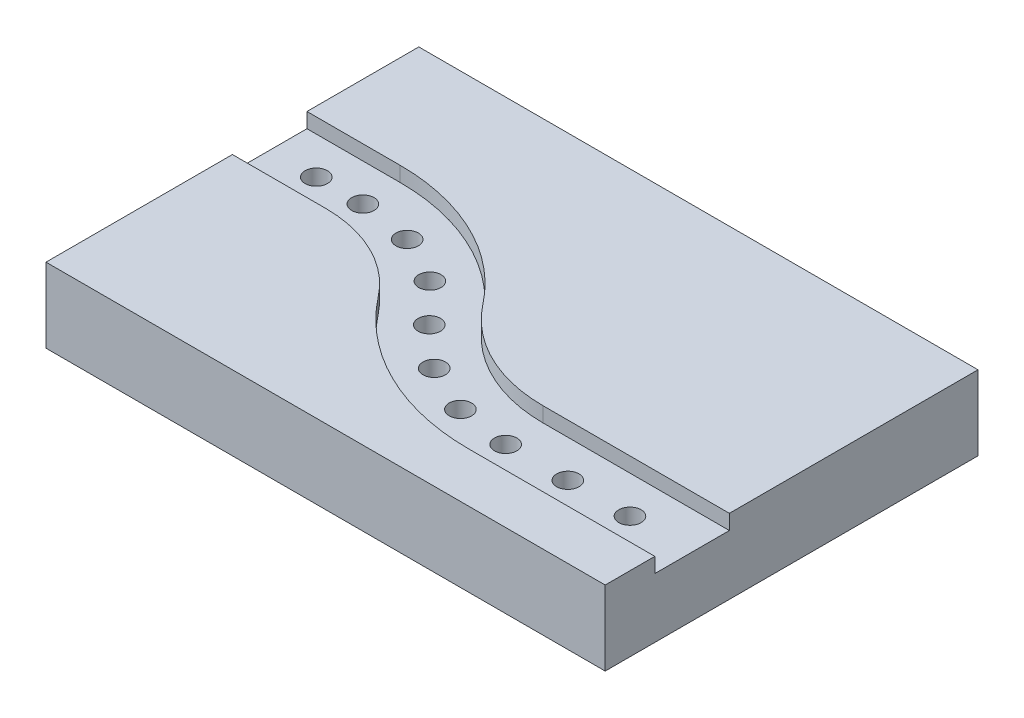
ISO-10303-21;
HEADER;
FILE_DESCRIPTION(('STEP AP214'),'2;1');
FILE_NAME('part.step','',(''),(''),'','','');
FILE_SCHEMA(('AUTOMOTIVE_DESIGN { 1 0 10303 214 1 1 1 1 }'));
ENDSEC;
DATA;
#1=APPLICATION_CONTEXT('core data for automotive mechanical design processes');
#2=APPLICATION_PROTOCOL_DEFINITION('international standard','automotive_design',2000,#1);
#3=PRODUCT_CONTEXT('',#1,'mechanical');
#4=PRODUCT('Part','Part','',(#3));
#5=PRODUCT_RELATED_PRODUCT_CATEGORY('part','',(#4));
#6=PRODUCT_DEFINITION_FORMATION('','',#4);
#7=PRODUCT_DEFINITION_CONTEXT('part definition',#1,'design');
#8=PRODUCT_DEFINITION('design','',#6,#7);
#9=PRODUCT_DEFINITION_SHAPE('','',#8);
#10=(LENGTH_UNIT() NAMED_UNIT(*) SI_UNIT(.MILLI.,.METRE.));
#11=(NAMED_UNIT(*) PLANE_ANGLE_UNIT() SI_UNIT($,.RADIAN.));
#12=(NAMED_UNIT(*) SI_UNIT($,.STERADIAN.) SOLID_ANGLE_UNIT());
#13=UNCERTAINTY_MEASURE_WITH_UNIT(LENGTH_MEASURE(1.E-05),#10,'distance_accuracy_value','');
#14=(GEOMETRIC_REPRESENTATION_CONTEXT(3) GLOBAL_UNCERTAINTY_ASSIGNED_CONTEXT((#13)) GLOBAL_UNIT_ASSIGNED_CONTEXT((#10,
#11,#12)) REPRESENTATION_CONTEXT('',''));
#15=CARTESIAN_POINT('',(0.,0.,0.));
#16=DIRECTION('',(0.,0.,1.));
#17=DIRECTION('',(1.,0.,0.));
#18=AXIS2_PLACEMENT_3D('',#15,#16,#17);
#19=CARTESIAN_POINT('',(0.,20.,0.));
#20=DIRECTION('',(0.,1.,0.));
#21=DIRECTION('',(0.,0.,1.));
#22=AXIS2_PLACEMENT_3D('',#19,#20,#21);
#23=PLANE('',#22);
#24=DIRECTION('',(0.,0.,1.));
#25=VECTOR('',#24,1.);
#26=CARTESIAN_POINT('',(0.,20.,0.));
#27=LINE('',#26,#25);
#28=CARTESIAN_POINT('',(0.,20.,0.));
#29=VERTEX_POINT('',#28);
#30=CARTESIAN_POINT('',(0.,20.,30.));
#31=VERTEX_POINT('',#30);
#32=EDGE_CURVE('E267',#29,#31,#27,.T.);
#33=ORIENTED_EDGE('',*,*,#32,.T.);
#34=DIRECTION('',(1.,0.,0.));
#35=VECTOR('',#34,1.);
#36=CARTESIAN_POINT('',(0.,20.,30.));
#37=LINE('',#36,#35);
#38=CARTESIAN_POINT('',(25.,20.,30.));
#39=VERTEX_POINT('',#38);
#40=EDGE_CURVE('E237',#31,#39,#37,.T.);
#41=ORIENTED_EDGE('',*,*,#40,.T.);
#42=CARTESIAN_POINT('',(25.,20.,85.));
#43=DIRECTION('',(0.,1.,0.));
#44=DIRECTION('',(1.,0.,0.));
#45=AXIS2_PLACEMENT_3D('',#42,#43,#44);
#46=CIRCLE('',#45,55.);
#47=CARTESIAN_POINT('',(68.421052631579,20.,51.2418574508957));
#48=VERTEX_POINT('',#47);
#49=EDGE_CURVE('E234',#39,#48,#46,.F.);
#50=ORIENTED_EDGE('',*,*,#49,.T.);
#51=CARTESIAN_POINT('',(100.,20.,26.690481051547));
#52=DIRECTION('',(0.,1.,0.));
#53=DIRECTION('',(1.,0.,0.));
#54=AXIS2_PLACEMENT_3D('',#51,#52,#53);
#55=CIRCLE('',#54,40.);
#56=CARTESIAN_POINT('',(100.,20.,66.6904810515471));
#57=VERTEX_POINT('',#56);
#58=EDGE_CURVE('E231',#48,#57,#55,.T.);
#59=ORIENTED_EDGE('',*,*,#58,.T.);
#60=DIRECTION('',(1.,0.,0.));
#61=VECTOR('',#60,1.);
#62=CARTESIAN_POINT('',(100.,20.,66.6904810515471));
#63=LINE('',#62,#61);
#64=CARTESIAN_POINT('',(150.,20.,66.6904810515471));
#65=VERTEX_POINT('',#64);
#66=EDGE_CURVE('E228',#57,#65,#63,.T.);
#67=ORIENTED_EDGE('',*,*,#66,.T.);
#68=DIRECTION('',(0.,0.,-1.));
#69=VECTOR('',#68,1.);
#70=CARTESIAN_POINT('',(150.,20.,0.));
#71=LINE('',#70,#69);
#72=CARTESIAN_POINT('',(150.,20.,0.));
#73=VERTEX_POINT('',#72);
#74=EDGE_CURVE('E271',#65,#73,#71,.T.);
#75=ORIENTED_EDGE('',*,*,#74,.T.);
#76=DIRECTION('',(-1.,0.,0.));
#77=VECTOR('',#76,1.);
#78=CARTESIAN_POINT('',(0.,20.,0.));
#79=LINE('',#78,#77);
#80=EDGE_CURVE('E94',#73,#29,#79,.T.);
#81=ORIENTED_EDGE('',*,*,#80,.T.);
#82=EDGE_LOOP('',(#33,#41,#50,#59,#67,#75,#81));
#83=FACE_BOUND('',#82,.T.);
#84=ADVANCED_FACE('F70',(#83),#23,.T.);
#85=CARTESIAN_POINT('',(0.,20.,0.));
#86=DIRECTION('',(1.,0.,0.));
#87=DIRECTION('',(0.,0.,-1.));
#88=AXIS2_PLACEMENT_3D('',#85,#86,#87);
#89=PLANE('',#88);
#90=CARTESIAN_POINT('',(0.,20.,50.));
#91=VERTEX_POINT('',#90);
#92=CARTESIAN_POINT('',(0.,20.,100.));
#93=VERTEX_POINT('',#92);
#94=EDGE_CURVE('E123',#91,#93,#27,.T.);
#95=ORIENTED_EDGE('',*,*,#94,.F.);
#96=DIRECTION('',(0.,1.,0.));
#97=VECTOR('',#96,1.);
#98=CARTESIAN_POINT('',(0.,16.,50.));
#99=LINE('',#98,#97);
#100=CARTESIAN_POINT('',(0.,16.,50.));
#101=VERTEX_POINT('',#100);
#102=EDGE_CURVE('E255',#101,#91,#99,.T.);
#103=ORIENTED_EDGE('',*,*,#102,.F.);
#104=DIRECTION('',(0.,0.,-1.));
#105=VECTOR('',#104,1.);
#106=CARTESIAN_POINT('',(0.,16.,50.));
#107=LINE('',#106,#105);
#108=CARTESIAN_POINT('',(0.,16.,30.));
#109=VERTEX_POINT('',#108);
#110=EDGE_CURVE('E218',#101,#109,#107,.T.);
#111=ORIENTED_EDGE('',*,*,#110,.T.);
#112=DIRECTION('',(0.,1.,0.));
#113=VECTOR('',#112,1.);
#114=CARTESIAN_POINT('',(0.,16.,30.));
#115=LINE('',#114,#113);
#116=EDGE_CURVE('E257',#109,#31,#115,.T.);
#117=ORIENTED_EDGE('',*,*,#116,.T.);
#118=ORIENTED_EDGE('',*,*,#32,.F.);
#119=DIRECTION('',(0.,-1.,0.));
#120=VECTOR('',#119,1.);
#121=CARTESIAN_POINT('',(0.,20.,0.));
#122=LINE('',#121,#120);
#123=CARTESIAN_POINT('',(0.,0.,0.));
#124=VERTEX_POINT('',#123);
#125=EDGE_CURVE('E275',#29,#124,#122,.T.);
#126=ORIENTED_EDGE('',*,*,#125,.T.);
#127=DIRECTION('',(0.,0.,1.));
#128=VECTOR('',#127,1.);
#129=CARTESIAN_POINT('',(0.,0.,0.));
#130=LINE('',#129,#128);
#131=CARTESIAN_POINT('',(0.,0.,100.));
#132=VERTEX_POINT('',#131);
#133=EDGE_CURVE('E250',#124,#132,#130,.T.);
#134=ORIENTED_EDGE('',*,*,#133,.T.);
#135=DIRECTION('',(0.,-1.,0.));
#136=VECTOR('',#135,1.);
#137=CARTESIAN_POINT('',(0.,20.,100.));
#138=LINE('',#137,#136);
#139=EDGE_CURVE('E13',#93,#132,#138,.T.);
#140=ORIENTED_EDGE('',*,*,#139,.F.);
#141=EDGE_LOOP('',(#95,#103,#111,#117,#118,#126,#134,#140));
#142=FACE_BOUND('',#141,.T.);
#143=ADVANCED_FACE('F72',(#142),#89,.F.);
#144=CARTESIAN_POINT('',(0.,20.,100.));
#145=DIRECTION('',(0.,0.,-1.));
#146=DIRECTION('',(-1.,0.,0.));
#147=AXIS2_PLACEMENT_3D('',#144,#145,#146);
#148=PLANE('',#147);
#149=DIRECTION('',(1.,0.,0.));
#150=VECTOR('',#149,1.);
#151=CARTESIAN_POINT('',(0.,0.,100.));
#152=LINE('',#151,#150);
#153=CARTESIAN_POINT('',(150.,0.,100.));
#154=VERTEX_POINT('',#153);
#155=EDGE_CURVE('E278',#132,#154,#152,.T.);
#156=ORIENTED_EDGE('',*,*,#155,.T.);
#157=DIRECTION('',(0.,-1.,0.));
#158=VECTOR('',#157,1.);
#159=CARTESIAN_POINT('',(150.,20.,100.));
#160=LINE('',#159,#158);
#161=CARTESIAN_POINT('',(150.,20.,100.));
#162=VERTEX_POINT('',#161);
#163=EDGE_CURVE('E78',#162,#154,#160,.T.);
#164=ORIENTED_EDGE('',*,*,#163,.F.);
#165=DIRECTION('',(1.,0.,0.));
#166=VECTOR('',#165,1.);
#167=CARTESIAN_POINT('',(0.,20.,100.));
#168=LINE('',#167,#166);
#169=EDGE_CURVE('E269',#93,#162,#168,.T.);
#170=ORIENTED_EDGE('',*,*,#169,.F.);
#171=ORIENTED_EDGE('',*,*,#139,.T.);
#172=EDGE_LOOP('',(#156,#164,#170,#171));
#173=FACE_BOUND('',#172,.T.);
#174=ADVANCED_FACE('F325',(#173),#148,.F.);
#175=CARTESIAN_POINT('',(150.,20.,0.));
#176=DIRECTION('',(-1.,0.,0.));
#177=DIRECTION('',(0.,0.,1.));
#178=AXIS2_PLACEMENT_3D('',#175,#176,#177);
#179=PLANE('',#178);
#180=DIRECTION('',(0.,0.,1.));
#181=VECTOR('',#180,1.);
#182=CARTESIAN_POINT('',(150.,16.,66.6904810515471));
#183=LINE('',#182,#181);
#184=CARTESIAN_POINT('',(150.,16.,66.6904810515471));
#185=VERTEX_POINT('',#184);
#186=CARTESIAN_POINT('',(150.,16.,86.690481051547));
#187=VERTEX_POINT('',#186);
#188=EDGE_CURVE('E200',#185,#187,#183,.T.);
#189=ORIENTED_EDGE('',*,*,#188,.T.);
#190=DIRECTION('',(0.,1.,0.));
#191=VECTOR('',#190,1.);
#192=CARTESIAN_POINT('',(150.,16.,86.690481051547));
#193=LINE('',#192,#191);
#194=CARTESIAN_POINT('',(150.,20.,86.690481051547));
#195=VERTEX_POINT('',#194);
#196=EDGE_CURVE('E183',#187,#195,#193,.T.);
#197=ORIENTED_EDGE('',*,*,#196,.T.);
#198=EDGE_CURVE('E272',#162,#195,#71,.T.);
#199=ORIENTED_EDGE('',*,*,#198,.F.);
#200=ORIENTED_EDGE('',*,*,#163,.T.);
#201=DIRECTION('',(0.,0.,-1.));
#202=VECTOR('',#201,1.);
#203=CARTESIAN_POINT('',(150.,0.,0.));
#204=LINE('',#203,#202);
#205=CARTESIAN_POINT('',(150.,0.,0.));
#206=VERTEX_POINT('',#205);
#207=EDGE_CURVE('E280',#154,#206,#204,.T.);
#208=ORIENTED_EDGE('',*,*,#207,.T.);
#209=DIRECTION('',(0.,-1.,0.));
#210=VECTOR('',#209,1.);
#211=CARTESIAN_POINT('',(150.,20.,0.));
#212=LINE('',#211,#210);
#213=EDGE_CURVE('E285',#73,#206,#212,.T.);
#214=ORIENTED_EDGE('',*,*,#213,.F.);
#215=ORIENTED_EDGE('',*,*,#74,.F.);
#216=DIRECTION('',(0.,1.,0.));
#217=VECTOR('',#216,1.);
#218=CARTESIAN_POINT('',(150.,16.,66.6904810515471));
#219=LINE('',#218,#217);
#220=EDGE_CURVE('E85',#185,#65,#219,.T.);
#221=ORIENTED_EDGE('',*,*,#220,.F.);
#222=EDGE_LOOP('',(#189,#197,#199,#200,#208,#214,#215,#221));
#223=FACE_BOUND('',#222,.T.);
#224=ADVANCED_FACE('F205',(#223),#179,.F.);
#225=CARTESIAN_POINT('',(0.,20.,0.));
#226=DIRECTION('',(0.,0.,1.));
#227=DIRECTION('',(1.,0.,0.));
#228=AXIS2_PLACEMENT_3D('',#225,#226,#227);
#229=PLANE('',#228);
#230=DIRECTION('',(-1.,0.,0.));
#231=VECTOR('',#230,1.);
#232=CARTESIAN_POINT('',(0.,0.,0.));
#233=LINE('',#232,#231);
#234=EDGE_CURVE('E115',#206,#124,#233,.T.);
#235=ORIENTED_EDGE('',*,*,#234,.T.);
#236=ORIENTED_EDGE('',*,*,#125,.F.);
#237=ORIENTED_EDGE('',*,*,#80,.F.);
#238=ORIENTED_EDGE('',*,*,#213,.T.);
#239=EDGE_LOOP('',(#235,#236,#237,#238));
#240=FACE_BOUND('',#239,.T.);
#241=ADVANCED_FACE('F297',(#240),#229,.F.);
#242=DIRECTION('',(1.,0.,0.));
#243=VECTOR('',#242,1.);
#244=CARTESIAN_POINT('',(100.,20.,86.690481051547));
#245=LINE('',#244,#243);
#246=CARTESIAN_POINT('',(100.,20.,86.690481051547));
#247=VERTEX_POINT('',#246);
#248=EDGE_CURVE('E189',#247,#195,#245,.T.);
#249=ORIENTED_EDGE('',*,*,#248,.F.);
#250=CARTESIAN_POINT('',(100.,20.,26.690481051547));
#251=DIRECTION('',(0.,1.,0.));
#252=DIRECTION('',(1.,0.,0.));
#253=AXIS2_PLACEMENT_3D('',#250,#251,#252);
#254=CIRCLE('',#253,60.);
#255=CARTESIAN_POINT('',(52.6315789473684,20.,63.51754565057));
#256=VERTEX_POINT('',#255);
#257=EDGE_CURVE('E203',#256,#247,#254,.T.);
#258=ORIENTED_EDGE('',*,*,#257,.F.);
#259=CARTESIAN_POINT('',(25.,20.,85.));
#260=DIRECTION('',(0.,1.,0.));
#261=DIRECTION('',(1.,0.,0.));
#262=AXIS2_PLACEMENT_3D('',#259,#260,#261);
#263=CIRCLE('',#262,35.);
#264=CARTESIAN_POINT('',(25.,20.,50.));
#265=VERTEX_POINT('',#264);
#266=EDGE_CURVE('E243',#265,#256,#263,.F.);
#267=ORIENTED_EDGE('',*,*,#266,.F.);
#268=DIRECTION('',(1.,0.,0.));
#269=VECTOR('',#268,1.);
#270=CARTESIAN_POINT('',(0.,20.,50.));
#271=LINE('',#270,#269);
#272=EDGE_CURVE('E240',#91,#265,#271,.T.);
#273=ORIENTED_EDGE('',*,*,#272,.F.);
#274=ORIENTED_EDGE('',*,*,#94,.T.);
#275=ORIENTED_EDGE('',*,*,#169,.T.);
#276=ORIENTED_EDGE('',*,*,#198,.T.);
#277=EDGE_LOOP('',(#249,#258,#267,#273,#274,#275,#276));
#278=FACE_BOUND('',#277,.T.);
#279=ADVANCED_FACE('F318',(#278),#23,.T.);
#280=CARTESIAN_POINT('',(0.,0.,0.));
#281=DIRECTION('',(0.,1.,0.));
#282=DIRECTION('',(0.,0.,1.));
#283=AXIS2_PLACEMENT_3D('',#280,#281,#282);
#284=PLANE('',#283);
#285=CARTESIAN_POINT('',(100.,0.,76.6904810515471));
#286=DIRECTION('',(0.,1.,0.));
#287=DIRECTION('',(0.,0.,1.));
#288=AXIS2_PLACEMENT_3D('',#285,#286,#287);
#289=CIRCLE('',#288,3.);
#290=CARTESIAN_POINT('',(100.,0.,79.6904810515471));
#291=VERTEX_POINT('',#290);
#292=EDGE_CURVE('E546',#291,#291,#289,.T.);
#293=ORIENTED_EDGE('',*,*,#292,.T.);
#294=EDGE_LOOP('',(#293));
#295=FACE_BOUND('',#294,.T.);
#296=CARTESIAN_POINT('',(85.7909951199552,0.,74.6290269235159));
#297=DIRECTION('',(0.,1.,0.));
#298=DIRECTION('',(-0.284180097600883,0.,0.958770917439381));
#299=AXIS2_PLACEMENT_3D('',#296,#297,#298);
#300=CIRCLE('',#299,3.);
#301=CARTESIAN_POINT('',(84.9384548271526,0.,77.505339675834));
#302=VERTEX_POINT('',#301);
#303=EDGE_CURVE('E550',#302,#302,#300,.T.);
#304=ORIENTED_EDGE('',*,*,#303,.T.);
#305=EDGE_LOOP('',(#304));
#306=FACE_BOUND('',#305,.T.);
#307=CARTESIAN_POINT('',(72.7536387105177,0.,68.6146482643015));
#308=DIRECTION('',(0.,1.,0.));
#309=DIRECTION('',(-0.544927225789634,0.,0.838483344255098));
#310=AXIS2_PLACEMENT_3D('',#307,#308,#309);
#311=CIRCLE('',#310,3.);
#312=CARTESIAN_POINT('',(71.1188570331488,0.,71.1300982970668));
#313=VERTEX_POINT('',#312);
#314=EDGE_CURVE('E559',#313,#313,#311,.T.);
#315=ORIENTED_EDGE('',*,*,#314,.T.);
#316=EDGE_LOOP('',(#315));
#317=FACE_BOUND('',#316,.T.);
#318=CARTESIAN_POINT('',(61.9629672592414,0.,59.1432797024871));
#319=DIRECTION('',(0.,1.,0.));
#320=DIRECTION('',(-0.760740654815163,0.,0.649055973018813));
#321=AXIS2_PLACEMENT_3D('',#318,#319,#320);
#322=CIRCLE('',#321,3.);
#323=CARTESIAN_POINT('',(59.6807452947959,0.,61.0904476215436));
#324=VERTEX_POINT('',#323);
#325=EDGE_CURVE('E565',#324,#324,#322,.T.);
#326=ORIENTED_EDGE('',*,*,#325,.T.);
#327=EDGE_LOOP('',(#326));
#328=FACE_BOUND('',#327,.T.);
#329=CARTESIAN_POINT('',(51.8859178089722,0.,48.9147201262178));
#330=DIRECTION('',(0.,1.,0.));
#331=DIRECTION('',(-0.59746484019937,0.,0.801895108306281));
#332=AXIS2_PLACEMENT_3D('',#329,#330,#331);
#333=CIRCLE('',#332,3.);
#334=CARTESIAN_POINT('',(50.093523288374,0.,51.3204054511366));
#335=VERTEX_POINT('',#334);
#336=EDGE_CURVE('E571',#335,#335,#333,.T.);
#337=ORIENTED_EDGE('',*,*,#336,.T.);
#338=EDGE_LOOP('',(#337));
#339=FACE_BOUND('',#338,.T.);
#340=CARTESIAN_POINT('',(39.1626693402021,0.,42.2867842798028));
#341=DIRECTION('',(0.,1.,0.));
#342=DIRECTION('',(-0.31472598533781,0.,0.949182571559942));
#343=AXIS2_PLACEMENT_3D('',#340,#341,#342);
#344=CIRCLE('',#343,3.);
#345=CARTESIAN_POINT('',(38.2184913841886,0.,45.1343319944826));
#346=VERTEX_POINT('',#345);
#347=EDGE_CURVE('E577',#346,#346,#344,.T.);
#348=ORIENTED_EDGE('',*,*,#347,.T.);
#349=EDGE_LOOP('',(#348));
#350=FACE_BOUND('',#349,.T.);
#351=CARTESIAN_POINT('',(133.333333333333,0.,76.6904810515471));
#352=DIRECTION('',(0.,1.,0.));
#353=DIRECTION('',(0.,0.,1.));
#354=AXIS2_PLACEMENT_3D('',#351,#352,#353);
#355=CIRCLE('',#354,3.);
#356=CARTESIAN_POINT('',(133.333333333333,0.,79.6904810515471));
#357=VERTEX_POINT('',#356);
#358=EDGE_CURVE('E583',#357,#357,#355,.T.);
#359=ORIENTED_EDGE('',*,*,#358,.T.);
#360=EDGE_LOOP('',(#359));
#361=FACE_BOUND('',#360,.T.);
#362=CARTESIAN_POINT('',(116.666666666667,0.,76.6904810515471));
#363=DIRECTION('',(0.,1.,0.));
#364=DIRECTION('',(0.,0.,1.));
#365=AXIS2_PLACEMENT_3D('',#362,#363,#364);
#366=CIRCLE('',#365,3.);
#367=CARTESIAN_POINT('',(116.666666666667,0.,79.6904810515471));
#368=VERTEX_POINT('',#367);
#369=EDGE_CURVE('E589',#368,#368,#366,.T.);
#370=ORIENTED_EDGE('',*,*,#369,.T.);
#371=EDGE_LOOP('',(#370));
#372=FACE_BOUND('',#371,.T.);
#373=CARTESIAN_POINT('',(12.5,0.,40.));
#374=DIRECTION('',(0.,1.,0.));
#375=DIRECTION('',(0.,0.,1.));
#376=AXIS2_PLACEMENT_3D('',#373,#374,#375);
#377=CIRCLE('',#376,3.);
#378=CARTESIAN_POINT('',(12.5,0.,43.));
#379=VERTEX_POINT('',#378);
#380=EDGE_CURVE('E595',#379,#379,#377,.T.);
#381=ORIENTED_EDGE('',*,*,#380,.T.);
#382=EDGE_LOOP('',(#381));
#383=FACE_BOUND('',#382,.T.);
#384=CARTESIAN_POINT('',(25.,0.,40.));
#385=DIRECTION('',(0.,1.,0.));
#386=DIRECTION('',(0.,0.,1.));
#387=AXIS2_PLACEMENT_3D('',#384,#385,#386);
#388=CIRCLE('',#387,3.);
#389=CARTESIAN_POINT('',(25.,0.,43.));
#390=VERTEX_POINT('',#389);
#391=EDGE_CURVE('E229',#390,#390,#388,.T.);
#392=ORIENTED_EDGE('',*,*,#391,.T.);
#393=EDGE_LOOP('',(#392));
#394=FACE_BOUND('',#393,.T.);
#395=ORIENTED_EDGE('',*,*,#133,.F.);
#396=ORIENTED_EDGE('',*,*,#234,.F.);
#397=ORIENTED_EDGE('',*,*,#207,.F.);
#398=ORIENTED_EDGE('',*,*,#155,.F.);
#399=EDGE_LOOP('',(#395,#396,#397,#398));
#400=FACE_BOUND('',#399,.T.);
#401=ADVANCED_FACE('F293',(#295,#306,#317,#328,#339,#350,#361,#372,#383,#394,#400),#284,.F.);
#402=CARTESIAN_POINT('',(100.,16.,86.690481051547));
#403=DIRECTION('',(0.,0.,1.));
#404=DIRECTION('',(1.,0.,0.));
#405=AXIS2_PLACEMENT_3D('',#402,#403,#404);
#406=PLANE('',#405);
#407=ORIENTED_EDGE('',*,*,#248,.T.);
#408=ORIENTED_EDGE('',*,*,#196,.F.);
#409=DIRECTION('',(1.,0.,0.));
#410=VECTOR('',#409,1.);
#411=CARTESIAN_POINT('',(100.,16.,86.690481051547));
#412=LINE('',#411,#410);
#413=CARTESIAN_POINT('',(100.,16.,86.690481051547));
#414=VERTEX_POINT('',#413);
#415=EDGE_CURVE('E186',#414,#187,#412,.T.);
#416=ORIENTED_EDGE('',*,*,#415,.F.);
#417=DIRECTION('',(0.,1.,0.));
#418=VECTOR('',#417,1.);
#419=CARTESIAN_POINT('',(100.,16.,86.690481051547));
#420=LINE('',#419,#418);
#421=EDGE_CURVE('E248',#414,#247,#420,.T.);
#422=ORIENTED_EDGE('',*,*,#421,.T.);
#423=EDGE_LOOP('',(#407,#408,#416,#422));
#424=FACE_BOUND('',#423,.T.);
#425=ADVANCED_FACE('F185',(#424),#406,.F.);
#426=CARTESIAN_POINT('',(100.,16.,26.690481051547));
#427=DIRECTION('',(0.,1.,0.));
#428=DIRECTION('',(0.,0.,1.));
#429=AXIS2_PLACEMENT_3D('',#426,#427,#428);
#430=CYLINDRICAL_SURFACE('',#429,60.);
#431=ORIENTED_EDGE('',*,*,#257,.T.);
#432=ORIENTED_EDGE('',*,*,#421,.F.);
#433=CARTESIAN_POINT('',(100.,16.,26.690481051547));
#434=DIRECTION('',(0.,1.,0.));
#435=DIRECTION('',(1.,0.,0.));
#436=AXIS2_PLACEMENT_3D('',#433,#434,#435);
#437=CIRCLE('',#436,60.);
#438=CARTESIAN_POINT('',(52.6315789473684,16.,63.51754565057));
#439=VERTEX_POINT('',#438);
#440=EDGE_CURVE('E194',#439,#414,#437,.T.);
#441=ORIENTED_EDGE('',*,*,#440,.F.);
#442=DIRECTION('',(0.,1.,0.));
#443=VECTOR('',#442,1.);
#444=CARTESIAN_POINT('',(52.6315789473684,16.,63.51754565057));
#445=LINE('',#444,#443);
#446=EDGE_CURVE('E251',#439,#256,#445,.T.);
#447=ORIENTED_EDGE('',*,*,#446,.T.);
#448=EDGE_LOOP('',(#431,#432,#441,#447));
#449=FACE_BOUND('',#448,.T.);
#450=ADVANCED_FACE('F324',(#449),#430,.F.);
#451=CARTESIAN_POINT('',(25.,16.,85.));
#452=DIRECTION('',(0.,1.,0.));
#453=DIRECTION('',(0.,0.,1.));
#454=AXIS2_PLACEMENT_3D('',#451,#452,#453);
#455=CYLINDRICAL_SURFACE('',#454,35.);
#456=ORIENTED_EDGE('',*,*,#266,.T.);
#457=ORIENTED_EDGE('',*,*,#446,.F.);
#458=CARTESIAN_POINT('',(25.,16.,85.));
#459=DIRECTION('',(0.,1.,0.));
#460=DIRECTION('',(1.,0.,0.));
#461=AXIS2_PLACEMENT_3D('',#458,#459,#460);
#462=CIRCLE('',#461,35.);
#463=CARTESIAN_POINT('',(25.,16.,50.));
#464=VERTEX_POINT('',#463);
#465=EDGE_CURVE('E224',#464,#439,#462,.F.);
#466=ORIENTED_EDGE('',*,*,#465,.F.);
#467=DIRECTION('',(0.,1.,0.));
#468=VECTOR('',#467,1.);
#469=CARTESIAN_POINT('',(25.,16.,50.));
#470=LINE('',#469,#468);
#471=EDGE_CURVE('E253',#464,#265,#470,.T.);
#472=ORIENTED_EDGE('',*,*,#471,.T.);
#473=EDGE_LOOP('',(#456,#457,#466,#472));
#474=FACE_BOUND('',#473,.T.);
#475=ADVANCED_FACE('F321',(#474),#455,.T.);
#476=CARTESIAN_POINT('',(0.,16.,50.));
#477=DIRECTION('',(0.,0.,1.));
#478=DIRECTION('',(1.,0.,0.));
#479=AXIS2_PLACEMENT_3D('',#476,#477,#478);
#480=PLANE('',#479);
#481=ORIENTED_EDGE('',*,*,#272,.T.);
#482=ORIENTED_EDGE('',*,*,#471,.F.);
#483=DIRECTION('',(1.,0.,0.));
#484=VECTOR('',#483,1.);
#485=CARTESIAN_POINT('',(0.,16.,50.));
#486=LINE('',#485,#484);
#487=EDGE_CURVE('E221',#101,#464,#486,.T.);
#488=ORIENTED_EDGE('',*,*,#487,.F.);
#489=ORIENTED_EDGE('',*,*,#102,.T.);
#490=EDGE_LOOP('',(#481,#482,#488,#489));
#491=FACE_BOUND('',#490,.T.);
#492=ADVANCED_FACE('F316',(#491),#480,.F.);
#493=CARTESIAN_POINT('',(0.,16.,30.));
#494=DIRECTION('',(0.,0.,1.));
#495=DIRECTION('',(1.,0.,0.));
#496=AXIS2_PLACEMENT_3D('',#493,#494,#495);
#497=PLANE('',#496);
#498=ORIENTED_EDGE('',*,*,#40,.F.);
#499=ORIENTED_EDGE('',*,*,#116,.F.);
#500=DIRECTION('',(1.,0.,0.));
#501=VECTOR('',#500,1.);
#502=CARTESIAN_POINT('',(0.,16.,30.));
#503=LINE('',#502,#501);
#504=CARTESIAN_POINT('',(25.,16.,30.));
#505=VERTEX_POINT('',#504);
#506=EDGE_CURVE('E216',#109,#505,#503,.T.);
#507=ORIENTED_EDGE('',*,*,#506,.T.);
#508=DIRECTION('',(0.,1.,0.));
#509=VECTOR('',#508,1.);
#510=CARTESIAN_POINT('',(25.,16.,30.));
#511=LINE('',#510,#509);
#512=EDGE_CURVE('E260',#505,#39,#511,.T.);
#513=ORIENTED_EDGE('',*,*,#512,.T.);
#514=EDGE_LOOP('',(#498,#499,#507,#513));
#515=FACE_BOUND('',#514,.T.);
#516=ADVANCED_FACE('F312',(#515),#497,.T.);
#517=CARTESIAN_POINT('',(25.,16.,85.));
#518=DIRECTION('',(0.,1.,0.));
#519=DIRECTION('',(0.,0.,1.));
#520=AXIS2_PLACEMENT_3D('',#517,#518,#519);
#521=CYLINDRICAL_SURFACE('',#520,55.);
#522=ORIENTED_EDGE('',*,*,#49,.F.);
#523=ORIENTED_EDGE('',*,*,#512,.F.);
#524=CARTESIAN_POINT('',(25.,16.,85.));
#525=DIRECTION('',(0.,1.,0.));
#526=DIRECTION('',(1.,0.,0.));
#527=AXIS2_PLACEMENT_3D('',#524,#525,#526);
#528=CIRCLE('',#527,55.);
#529=CARTESIAN_POINT('',(68.421052631579,16.,51.2418574508957));
#530=VERTEX_POINT('',#529);
#531=EDGE_CURVE('E214',#505,#530,#528,.F.);
#532=ORIENTED_EDGE('',*,*,#531,.T.);
#533=DIRECTION('',(0.,1.,0.));
#534=VECTOR('',#533,1.);
#535=CARTESIAN_POINT('',(68.421052631579,16.,51.2418574508957));
#536=LINE('',#535,#534);
#537=EDGE_CURVE('E262',#530,#48,#536,.T.);
#538=ORIENTED_EDGE('',*,*,#537,.T.);
#539=EDGE_LOOP('',(#522,#523,#532,#538));
#540=FACE_BOUND('',#539,.T.);
#541=ADVANCED_FACE('F309',(#540),#521,.F.);
#542=CARTESIAN_POINT('',(100.,16.,26.690481051547));
#543=DIRECTION('',(0.,1.,0.));
#544=DIRECTION('',(0.,0.,1.));
#545=AXIS2_PLACEMENT_3D('',#542,#543,#544);
#546=CYLINDRICAL_SURFACE('',#545,40.);
#547=ORIENTED_EDGE('',*,*,#58,.F.);
#548=ORIENTED_EDGE('',*,*,#537,.F.);
#549=CARTESIAN_POINT('',(100.,16.,26.690481051547));
#550=DIRECTION('',(0.,1.,0.));
#551=DIRECTION('',(1.,0.,0.));
#552=AXIS2_PLACEMENT_3D('',#549,#550,#551);
#553=CIRCLE('',#552,40.);
#554=CARTESIAN_POINT('',(100.,16.,66.6904810515471));
#555=VERTEX_POINT('',#554);
#556=EDGE_CURVE('E209',#530,#555,#553,.T.);
#557=ORIENTED_EDGE('',*,*,#556,.T.);
#558=DIRECTION('',(0.,1.,0.));
#559=VECTOR('',#558,1.);
#560=CARTESIAN_POINT('',(100.,16.,66.6904810515471));
#561=LINE('',#560,#559);
#562=EDGE_CURVE('E264',#555,#57,#561,.T.);
#563=ORIENTED_EDGE('',*,*,#562,.T.);
#564=EDGE_LOOP('',(#547,#548,#557,#563));
#565=FACE_BOUND('',#564,.T.);
#566=ADVANCED_FACE('F306',(#565),#546,.T.);
#567=CARTESIAN_POINT('',(100.,16.,66.6904810515471));
#568=DIRECTION('',(0.,0.,1.));
#569=DIRECTION('',(1.,0.,0.));
#570=AXIS2_PLACEMENT_3D('',#567,#568,#569);
#571=PLANE('',#570);
#572=ORIENTED_EDGE('',*,*,#66,.F.);
#573=ORIENTED_EDGE('',*,*,#562,.F.);
#574=DIRECTION('',(1.,0.,0.));
#575=VECTOR('',#574,1.);
#576=CARTESIAN_POINT('',(100.,16.,66.6904810515471));
#577=LINE('',#576,#575);
#578=EDGE_CURVE('E207',#555,#185,#577,.T.);
#579=ORIENTED_EDGE('',*,*,#578,.T.);
#580=ORIENTED_EDGE('',*,*,#220,.T.);
#581=EDGE_LOOP('',(#572,#573,#579,#580));
#582=FACE_BOUND('',#581,.T.);
#583=ADVANCED_FACE('F300',(#582),#571,.T.);
#584=CARTESIAN_POINT('',(100.,16.,26.690481051547));
#585=DIRECTION('',(0.,1.,0.));
#586=DIRECTION('',(1.,0.,0.));
#587=AXIS2_PLACEMENT_3D('',#584,#585,#586);
#588=PLANE('',#587);
#589=CARTESIAN_POINT('',(100.,16.,76.6904810515471));
#590=DIRECTION('',(0.,1.,0.));
#591=DIRECTION('',(0.,0.,1.));
#592=AXIS2_PLACEMENT_3D('',#589,#590,#591);
#593=CIRCLE('',#592,3.);
#594=CARTESIAN_POINT('',(100.,16.,79.6904810515471));
#595=VERTEX_POINT('',#594);
#596=EDGE_CURVE('E549',#595,#595,#593,.T.);
#597=ORIENTED_EDGE('',*,*,#596,.F.);
#598=EDGE_LOOP('',(#597));
#599=FACE_BOUND('',#598,.T.);
#600=CARTESIAN_POINT('',(85.7909951199552,16.,74.6290269235159));
#601=DIRECTION('',(0.,1.,0.));
#602=DIRECTION('',(-0.284180097600883,0.,0.958770917439381));
#603=AXIS2_PLACEMENT_3D('',#600,#601,#602);
#604=CIRCLE('',#603,3.);
#605=CARTESIAN_POINT('',(84.9384548271526,16.,77.505339675834));
#606=VERTEX_POINT('',#605);
#607=EDGE_CURVE('E553',#606,#606,#604,.T.);
#608=ORIENTED_EDGE('',*,*,#607,.F.);
#609=EDGE_LOOP('',(#608));
#610=FACE_BOUND('',#609,.T.);
#611=CARTESIAN_POINT('',(72.7536387105177,16.,68.6146482643015));
#612=DIRECTION('',(0.,1.,0.));
#613=DIRECTION('',(-0.544927225789634,0.,0.838483344255098));
#614=AXIS2_PLACEMENT_3D('',#611,#612,#613);
#615=CIRCLE('',#614,3.);
#616=CARTESIAN_POINT('',(71.1188570331488,16.,71.1300982970668));
#617=VERTEX_POINT('',#616);
#618=EDGE_CURVE('E562',#617,#617,#615,.T.);
#619=ORIENTED_EDGE('',*,*,#618,.F.);
#620=EDGE_LOOP('',(#619));
#621=FACE_BOUND('',#620,.T.);
#622=CARTESIAN_POINT('',(61.9629672592414,16.,59.1432797024871));
#623=DIRECTION('',(0.,1.,0.));
#624=DIRECTION('',(-0.760740654815163,0.,0.649055973018813));
#625=AXIS2_PLACEMENT_3D('',#622,#623,#624);
#626=CIRCLE('',#625,3.);
#627=CARTESIAN_POINT('',(59.680745294796,16.,61.0904476215436));
#628=VERTEX_POINT('',#627);
#629=EDGE_CURVE('E568',#628,#628,#626,.T.);
#630=ORIENTED_EDGE('',*,*,#629,.F.);
#631=EDGE_LOOP('',(#630));
#632=FACE_BOUND('',#631,.T.);
#633=CARTESIAN_POINT('',(51.8859178089722,16.,48.9147201262178));
#634=DIRECTION('',(0.,1.,0.));
#635=DIRECTION('',(-0.59746484019937,0.,0.801895108306281));
#636=AXIS2_PLACEMENT_3D('',#633,#634,#635);
#637=CIRCLE('',#636,3.);
#638=CARTESIAN_POINT('',(50.0935232883741,16.,51.3204054511366));
#639=VERTEX_POINT('',#638);
#640=EDGE_CURVE('E574',#639,#639,#637,.T.);
#641=ORIENTED_EDGE('',*,*,#640,.F.);
#642=EDGE_LOOP('',(#641));
#643=FACE_BOUND('',#642,.T.);
#644=CARTESIAN_POINT('',(39.1626693402021,16.,42.2867842798028));
#645=DIRECTION('',(0.,1.,0.));
#646=DIRECTION('',(-0.31472598533781,0.,0.949182571559942));
#647=AXIS2_PLACEMENT_3D('',#644,#645,#646);
#648=CIRCLE('',#647,3.);
#649=CARTESIAN_POINT('',(38.2184913841886,16.,45.1343319944826));
#650=VERTEX_POINT('',#649);
#651=EDGE_CURVE('E580',#650,#650,#648,.T.);
#652=ORIENTED_EDGE('',*,*,#651,.F.);
#653=EDGE_LOOP('',(#652));
#654=FACE_BOUND('',#653,.T.);
#655=CARTESIAN_POINT('',(133.333333333333,16.,76.6904810515471));
#656=DIRECTION('',(0.,1.,0.));
#657=DIRECTION('',(0.,0.,1.));
#658=AXIS2_PLACEMENT_3D('',#655,#656,#657);
#659=CIRCLE('',#658,3.);
#660=CARTESIAN_POINT('',(133.333333333333,16.,79.6904810515471));
#661=VERTEX_POINT('',#660);
#662=EDGE_CURVE('E586',#661,#661,#659,.T.);
#663=ORIENTED_EDGE('',*,*,#662,.F.);
#664=EDGE_LOOP('',(#663));
#665=FACE_BOUND('',#664,.T.);
#666=CARTESIAN_POINT('',(116.666666666667,16.,76.6904810515471));
#667=DIRECTION('',(0.,1.,0.));
#668=DIRECTION('',(0.,0.,1.));
#669=AXIS2_PLACEMENT_3D('',#666,#667,#668);
#670=CIRCLE('',#669,3.);
#671=CARTESIAN_POINT('',(116.666666666667,16.,79.6904810515471));
#672=VERTEX_POINT('',#671);
#673=EDGE_CURVE('E592',#672,#672,#670,.T.);
#674=ORIENTED_EDGE('',*,*,#673,.F.);
#675=EDGE_LOOP('',(#674));
#676=FACE_BOUND('',#675,.T.);
#677=CARTESIAN_POINT('',(12.5,16.,40.));
#678=DIRECTION('',(0.,1.,0.));
#679=DIRECTION('',(0.,0.,1.));
#680=AXIS2_PLACEMENT_3D('',#677,#678,#679);
#681=CIRCLE('',#680,3.);
#682=CARTESIAN_POINT('',(12.5,16.,43.));
#683=VERTEX_POINT('',#682);
#684=EDGE_CURVE('E598',#683,#683,#681,.T.);
#685=ORIENTED_EDGE('',*,*,#684,.F.);
#686=EDGE_LOOP('',(#685));
#687=FACE_BOUND('',#686,.T.);
#688=CARTESIAN_POINT('',(25.,16.,40.));
#689=DIRECTION('',(0.,1.,0.));
#690=DIRECTION('',(0.,0.,1.));
#691=AXIS2_PLACEMENT_3D('',#688,#689,#690);
#692=CIRCLE('',#691,3.);
#693=CARTESIAN_POINT('',(25.,16.,43.));
#694=VERTEX_POINT('',#693);
#695=EDGE_CURVE('E601',#694,#694,#692,.T.);
#696=ORIENTED_EDGE('',*,*,#695,.F.);
#697=EDGE_LOOP('',(#696));
#698=FACE_BOUND('',#697,.T.);
#699=ORIENTED_EDGE('',*,*,#415,.T.);
#700=ORIENTED_EDGE('',*,*,#188,.F.);
#701=ORIENTED_EDGE('',*,*,#578,.F.);
#702=ORIENTED_EDGE('',*,*,#556,.F.);
#703=ORIENTED_EDGE('',*,*,#531,.F.);
#704=ORIENTED_EDGE('',*,*,#506,.F.);
#705=ORIENTED_EDGE('',*,*,#110,.F.);
#706=ORIENTED_EDGE('',*,*,#487,.T.);
#707=ORIENTED_EDGE('',*,*,#465,.T.);
#708=ORIENTED_EDGE('',*,*,#440,.T.);
#709=EDGE_LOOP('',(#699,#700,#701,#702,#703,#704,#705,#706,#707,#708));
#710=FACE_BOUND('',#709,.T.);
#711=ADVANCED_FACE('F198',(#599,#610,#621,#632,#643,#654,#665,#676,#687,#698,#710),#588,.T.);
#712=CARTESIAN_POINT('',(25.,16.,40.));
#713=DIRECTION('',(0.,1.,0.));
#714=DIRECTION('',(0.,0.,1.));
#715=AXIS2_PLACEMENT_3D('',#712,#713,#714);
#716=CYLINDRICAL_SURFACE('',#715,3.);
#717=ORIENTED_EDGE('',*,*,#391,.F.);
#718=EDGE_LOOP('',(#717));
#719=FACE_BOUND('',#718,.T.);
#720=ORIENTED_EDGE('',*,*,#695,.T.);
#721=EDGE_LOOP('',(#720));
#722=FACE_BOUND('',#721,.T.);
#723=ADVANCED_FACE('F432',(#719,#722),#716,.F.);
#724=CARTESIAN_POINT('',(12.5,16.,40.));
#725=DIRECTION('',(0.,1.,0.));
#726=DIRECTION('',(0.,0.,1.));
#727=AXIS2_PLACEMENT_3D('',#724,#725,#726);
#728=CYLINDRICAL_SURFACE('',#727,3.);
#729=ORIENTED_EDGE('',*,*,#380,.F.);
#730=EDGE_LOOP('',(#729));
#731=FACE_BOUND('',#730,.T.);
#732=ORIENTED_EDGE('',*,*,#684,.T.);
#733=EDGE_LOOP('',(#732));
#734=FACE_BOUND('',#733,.T.);
#735=ADVANCED_FACE('F437',(#731,#734),#728,.F.);
#736=CARTESIAN_POINT('',(116.666666666667,16.,76.6904810515471));
#737=DIRECTION('',(0.,1.,0.));
#738=DIRECTION('',(0.,0.,1.));
#739=AXIS2_PLACEMENT_3D('',#736,#737,#738);
#740=CYLINDRICAL_SURFACE('',#739,3.);
#741=ORIENTED_EDGE('',*,*,#369,.F.);
#742=EDGE_LOOP('',(#741));
#743=FACE_BOUND('',#742,.T.);
#744=ORIENTED_EDGE('',*,*,#673,.T.);
#745=EDGE_LOOP('',(#744));
#746=FACE_BOUND('',#745,.T.);
#747=ADVANCED_FACE('F447',(#743,#746),#740,.F.);
#748=CARTESIAN_POINT('',(133.333333333333,16.,76.6904810515471));
#749=DIRECTION('',(0.,1.,0.));
#750=DIRECTION('',(0.,0.,1.));
#751=AXIS2_PLACEMENT_3D('',#748,#749,#750);
#752=CYLINDRICAL_SURFACE('',#751,3.);
#753=ORIENTED_EDGE('',*,*,#358,.F.);
#754=EDGE_LOOP('',(#753));
#755=FACE_BOUND('',#754,.T.);
#756=ORIENTED_EDGE('',*,*,#662,.T.);
#757=EDGE_LOOP('',(#756));
#758=FACE_BOUND('',#757,.T.);
#759=ADVANCED_FACE('F457',(#755,#758),#752,.F.);
#760=CARTESIAN_POINT('',(39.1626693402021,16.,42.2867842798028));
#761=DIRECTION('',(0.,1.,0.));
#762=DIRECTION('',(-0.31472598533781,0.,0.949182571559942));
#763=AXIS2_PLACEMENT_3D('',#760,#761,#762);
#764=CYLINDRICAL_SURFACE('',#763,3.);
#765=ORIENTED_EDGE('',*,*,#347,.F.);
#766=EDGE_LOOP('',(#765));
#767=FACE_BOUND('',#766,.T.);
#768=ORIENTED_EDGE('',*,*,#651,.T.);
#769=EDGE_LOOP('',(#768));
#770=FACE_BOUND('',#769,.T.);
#771=ADVANCED_FACE('F467',(#767,#770),#764,.F.);
#772=CARTESIAN_POINT('',(51.8859178089722,16.,48.9147201262178));
#773=DIRECTION('',(0.,1.,0.));
#774=DIRECTION('',(-0.59746484019937,0.,0.801895108306281));
#775=AXIS2_PLACEMENT_3D('',#772,#773,#774);
#776=CYLINDRICAL_SURFACE('',#775,3.);
#777=ORIENTED_EDGE('',*,*,#336,.F.);
#778=EDGE_LOOP('',(#777));
#779=FACE_BOUND('',#778,.T.);
#780=ORIENTED_EDGE('',*,*,#640,.T.);
#781=EDGE_LOOP('',(#780));
#782=FACE_BOUND('',#781,.T.);
#783=ADVANCED_FACE('F489',(#779,#782),#776,.F.);
#784=CARTESIAN_POINT('',(61.9629672592414,16.,59.1432797024871));
#785=DIRECTION('',(0.,1.,0.));
#786=DIRECTION('',(-0.760740654815163,0.,0.649055973018813));
#787=AXIS2_PLACEMENT_3D('',#784,#785,#786);
#788=CYLINDRICAL_SURFACE('',#787,3.);
#789=ORIENTED_EDGE('',*,*,#325,.F.);
#790=EDGE_LOOP('',(#789));
#791=FACE_BOUND('',#790,.T.);
#792=ORIENTED_EDGE('',*,*,#629,.T.);
#793=EDGE_LOOP('',(#792));
#794=FACE_BOUND('',#793,.T.);
#795=ADVANCED_FACE('F499',(#791,#794),#788,.F.);
#796=CARTESIAN_POINT('',(72.7536387105177,16.,68.6146482643015));
#797=DIRECTION('',(0.,1.,0.));
#798=DIRECTION('',(-0.544927225789634,0.,0.838483344255098));
#799=AXIS2_PLACEMENT_3D('',#796,#797,#798);
#800=CYLINDRICAL_SURFACE('',#799,3.);
#801=ORIENTED_EDGE('',*,*,#314,.F.);
#802=EDGE_LOOP('',(#801));
#803=FACE_BOUND('',#802,.T.);
#804=ORIENTED_EDGE('',*,*,#618,.T.);
#805=EDGE_LOOP('',(#804));
#806=FACE_BOUND('',#805,.T.);
#807=ADVANCED_FACE('F509',(#803,#806),#800,.F.);
#808=CARTESIAN_POINT('',(85.7909951199552,16.,74.6290269235159));
#809=DIRECTION('',(0.,1.,0.));
#810=DIRECTION('',(-0.284180097600883,0.,0.958770917439381));
#811=AXIS2_PLACEMENT_3D('',#808,#809,#810);
#812=CYLINDRICAL_SURFACE('',#811,3.);
#813=ORIENTED_EDGE('',*,*,#303,.F.);
#814=EDGE_LOOP('',(#813));
#815=FACE_BOUND('',#814,.T.);
#816=ORIENTED_EDGE('',*,*,#607,.T.);
#817=EDGE_LOOP('',(#816));
#818=FACE_BOUND('',#817,.T.);
#819=ADVANCED_FACE('F519',(#815,#818),#812,.F.);
#820=CARTESIAN_POINT('',(100.,16.,76.6904810515471));
#821=DIRECTION('',(0.,1.,0.));
#822=DIRECTION('',(0.,0.,1.));
#823=AXIS2_PLACEMENT_3D('',#820,#821,#822);
#824=CYLINDRICAL_SURFACE('',#823,3.);
#825=ORIENTED_EDGE('',*,*,#292,.F.);
#826=EDGE_LOOP('',(#825));
#827=FACE_BOUND('',#826,.T.);
#828=ORIENTED_EDGE('',*,*,#596,.T.);
#829=EDGE_LOOP('',(#828));
#830=FACE_BOUND('',#829,.T.);
#831=ADVANCED_FACE('F529',(#827,#830),#824,.F.);
#832=CLOSED_SHELL('',(#84,#143,#174,#224,#241,#279,#401,#425,#450,#475,#492,#516,#541,#566,#583,
#711,#723,#735,#747,#759,#771,#783,#795,#807,#819,#831));
#833=MANIFOLD_SOLID_BREP('B2',#832);
#834=ADVANCED_BREP_SHAPE_REPRESENTATION('',(#18,#833),#14);
#835=SHAPE_DEFINITION_REPRESENTATION(#9,#834);
ENDSEC;
END-ISO-10303-21;
